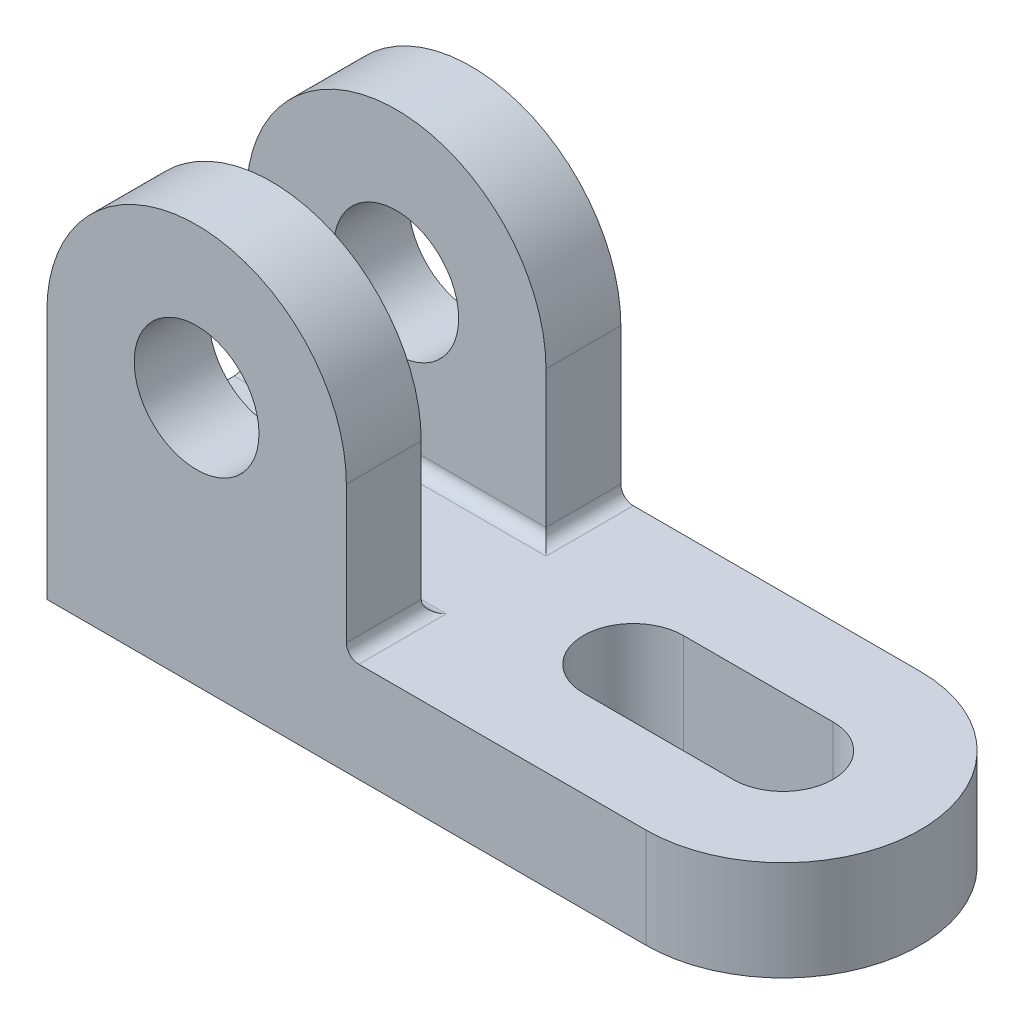
ISO-10303-21;
HEADER;
FILE_DESCRIPTION(('STEP AP214'),'2;1');
FILE_NAME('part.step','',(''),(''),'','','');
FILE_SCHEMA(('AUTOMOTIVE_DESIGN { 1 0 10303 214 1 1 1 1 }'));
ENDSEC;
DATA;
#1=APPLICATION_CONTEXT('core data for automotive mechanical design processes');
#2=APPLICATION_PROTOCOL_DEFINITION('international standard','automotive_design',2000,#1);
#3=PRODUCT_CONTEXT('',#1,'mechanical');
#4=PRODUCT('Part','Part','',(#3));
#5=PRODUCT_RELATED_PRODUCT_CATEGORY('part','',(#4));
#6=PRODUCT_DEFINITION_FORMATION('','',#4);
#7=PRODUCT_DEFINITION_CONTEXT('part definition',#1,'design');
#8=PRODUCT_DEFINITION('design','',#6,#7);
#9=PRODUCT_DEFINITION_SHAPE('','',#8);
#10=(LENGTH_UNIT() NAMED_UNIT(*) SI_UNIT(.MILLI.,.METRE.));
#11=(NAMED_UNIT(*) PLANE_ANGLE_UNIT() SI_UNIT($,.RADIAN.));
#12=(NAMED_UNIT(*) SI_UNIT($,.STERADIAN.) SOLID_ANGLE_UNIT());
#13=UNCERTAINTY_MEASURE_WITH_UNIT(LENGTH_MEASURE(1.E-05),#10,'distance_accuracy_value','');
#14=(GEOMETRIC_REPRESENTATION_CONTEXT(3) GLOBAL_UNCERTAINTY_ASSIGNED_CONTEXT((#13)) GLOBAL_UNIT_ASSIGNED_CONTEXT((#10,
#11,#12)) REPRESENTATION_CONTEXT('',''));
#15=CARTESIAN_POINT('',(0.,0.,0.));
#16=DIRECTION('',(0.,0.,1.));
#17=DIRECTION('',(1.,0.,0.));
#18=AXIS2_PLACEMENT_3D('',#15,#16,#17);
#19=CARTESIAN_POINT('',(0.,16.,0.));
#20=DIRECTION('',(0.,1.,0.));
#21=DIRECTION('',(0.,0.,1.));
#22=AXIS2_PLACEMENT_3D('',#19,#20,#21);
#23=PLANE('',#22);
#24=CARTESIAN_POINT('',(37.,16.,0.));
#25=DIRECTION('',(0.,1.,0.));
#26=DIRECTION('',(0.,0.,1.));
#27=AXIS2_PLACEMENT_3D('',#24,#25,#26);
#28=CIRCLE('',#27,8.);
#29=CARTESIAN_POINT('',(37.,16.,8.00000000000001));
#30=VERTEX_POINT('',#29);
#31=CARTESIAN_POINT('',(37.,16.,-7.99999999999999));
#32=VERTEX_POINT('',#31);
#33=EDGE_CURVE('E235',#30,#32,#28,.T.);
#34=ORIENTED_EDGE('',*,*,#33,.F.);
#35=DIRECTION('',(1.,0.,0.));
#36=VECTOR('',#35,1.);
#37=CARTESIAN_POINT('',(37.,16.,8.00000000000001));
#38=LINE('',#37,#36);
#39=CARTESIAN_POINT('',(13.,16.,8.));
#40=VERTEX_POINT('',#39);
#41=EDGE_CURVE('E244',#40,#30,#38,.T.);
#42=ORIENTED_EDGE('',*,*,#41,.F.);
#43=CARTESIAN_POINT('',(13.,16.,0.));
#44=DIRECTION('',(0.,1.,0.));
#45=DIRECTION('',(0.,0.,1.));
#46=AXIS2_PLACEMENT_3D('',#43,#44,#45);
#47=CIRCLE('',#46,8.);
#48=CARTESIAN_POINT('',(13.,16.,-7.99999999999999));
#49=VERTEX_POINT('',#48);
#50=EDGE_CURVE('E263',#49,#40,#47,.T.);
#51=ORIENTED_EDGE('',*,*,#50,.F.);
#52=DIRECTION('',(-1.,0.,0.));
#53=VECTOR('',#52,1.);
#54=CARTESIAN_POINT('',(37.,16.,-7.99999999999999));
#55=LINE('',#54,#53);
#56=EDGE_CURVE('E259',#32,#49,#55,.T.);
#57=ORIENTED_EDGE('',*,*,#56,.F.);
#58=EDGE_LOOP('',(#34,#42,#51,#57));
#59=FACE_BOUND('',#58,.T.);
#60=DIRECTION('',(0.,0.,-1.));
#61=VECTOR('',#60,1.);
#62=CARTESIAN_POINT('',(-8.99999999999998,16.,0.));
#63=LINE('',#62,#61);
#64=CARTESIAN_POINT('',(-8.99999999999998,16.,-22.));
#65=VERTEX_POINT('',#64);
#66=CARTESIAN_POINT('',(-8.99999999999998,16.,-8.));
#67=VERTEX_POINT('',#66);
#68=EDGE_CURVE('E335',#65,#67,#63,.F.);
#69=ORIENTED_EDGE('',*,*,#68,.T.);
#70=DIRECTION('',(-1.,0.,0.));
#71=VECTOR('',#70,1.);
#72=CARTESIAN_POINT('',(0.,16.,-8.));
#73=LINE('',#72,#71);
#74=CARTESIAN_POINT('',(-59.,16.,-8.));
#75=VERTEX_POINT('',#74);
#76=EDGE_CURVE('E338',#67,#75,#73,.T.);
#77=ORIENTED_EDGE('',*,*,#76,.T.);
#78=DIRECTION('',(0.,0.,1.));
#79=VECTOR('',#78,1.);
#80=CARTESIAN_POINT('',(-59.,16.,0.));
#81=LINE('',#80,#79);
#82=CARTESIAN_POINT('',(-59.,16.,8.));
#83=VERTEX_POINT('',#82);
#84=EDGE_CURVE('E294',#75,#83,#81,.T.);
#85=ORIENTED_EDGE('',*,*,#84,.T.);
#86=DIRECTION('',(-1.,0.,0.));
#87=VECTOR('',#86,1.);
#88=CARTESIAN_POINT('',(0.,16.,8.));
#89=LINE('',#88,#87);
#90=CARTESIAN_POINT('',(-8.99999999999998,16.,8.));
#91=VERTEX_POINT('',#90);
#92=EDGE_CURVE('E332',#83,#91,#89,.F.);
#93=ORIENTED_EDGE('',*,*,#92,.T.);
#94=DIRECTION('',(0.,0.,1.));
#95=VECTOR('',#94,1.);
#96=CARTESIAN_POINT('',(-8.99999999999998,16.,22.));
#97=LINE('',#96,#95);
#98=CARTESIAN_POINT('',(-8.99999999999998,16.,22.));
#99=VERTEX_POINT('',#98);
#100=EDGE_CURVE('E329',#91,#99,#97,.T.);
#101=ORIENTED_EDGE('',*,*,#100,.T.);
#102=DIRECTION('',(1.,0.,0.));
#103=VECTOR('',#102,1.);
#104=CARTESIAN_POINT('',(0.,16.,22.));
#105=LINE('',#104,#103);
#106=CARTESIAN_POINT('',(37.,16.,22.));
#107=VERTEX_POINT('',#106);
#108=EDGE_CURVE('E283',#99,#107,#105,.T.);
#109=ORIENTED_EDGE('',*,*,#108,.T.);
#110=CARTESIAN_POINT('',(37.,16.,0.));
#111=DIRECTION('',(0.,1.,0.));
#112=DIRECTION('',(0.,0.,1.));
#113=AXIS2_PLACEMENT_3D('',#110,#111,#112);
#114=CIRCLE('',#113,22.);
#115=CARTESIAN_POINT('',(37.,16.,-22.));
#116=VERTEX_POINT('',#115);
#117=EDGE_CURVE('E286',#107,#116,#114,.T.);
#118=ORIENTED_EDGE('',*,*,#117,.T.);
#119=DIRECTION('',(1.,0.,0.));
#120=VECTOR('',#119,1.);
#121=CARTESIAN_POINT('',(0.,16.,-22.));
#122=LINE('',#121,#120);
#123=EDGE_CURVE('E291',#65,#116,#122,.T.);
#124=ORIENTED_EDGE('',*,*,#123,.F.);
#125=EDGE_LOOP('',(#69,#77,#85,#93,#101,#109,#118,#124));
#126=FACE_BOUND('',#125,.T.);
#127=ADVANCED_FACE('F39',(#59,#126),#23,.T.);
#128=CARTESIAN_POINT('',(0.,16.,22.));
#129=DIRECTION('',(0.,0.,-1.));
#130=DIRECTION('',(-1.,0.,0.));
#131=AXIS2_PLACEMENT_3D('',#128,#129,#130);
#132=PLANE('',#131);
#133=DIRECTION('',(1.,0.,0.));
#134=VECTOR('',#133,1.);
#135=CARTESIAN_POINT('',(0.,0.,22.));
#136=LINE('',#135,#134);
#137=CARTESIAN_POINT('',(-59.,0.,22.));
#138=VERTEX_POINT('',#137);
#139=CARTESIAN_POINT('',(37.,0.,22.));
#140=VERTEX_POINT('',#139);
#141=EDGE_CURVE('E273',#138,#140,#136,.T.);
#142=ORIENTED_EDGE('',*,*,#141,.T.);
#143=DIRECTION('',(0.,-1.,0.));
#144=VECTOR('',#143,1.);
#145=CARTESIAN_POINT('',(37.,16.,22.));
#146=LINE('',#145,#144);
#147=EDGE_CURVE('E321',#107,#140,#146,.T.);
#148=ORIENTED_EDGE('',*,*,#147,.F.);
#149=ORIENTED_EDGE('',*,*,#108,.F.);
#150=CARTESIAN_POINT('',(-8.99999999999998,18.,22.));
#151=DIRECTION('',(0.,0.,-1.));
#152=DIRECTION('',(-1.,0.,0.));
#153=AXIS2_PLACEMENT_3D('',#150,#151,#152);
#154=CIRCLE('',#153,2.);
#155=CARTESIAN_POINT('',(-11.,18.,22.));
#156=VERTEX_POINT('',#155);
#157=EDGE_CURVE('E11',#99,#156,#154,.T.);
#158=ORIENTED_EDGE('',*,*,#157,.T.);
#159=DIRECTION('',(0.,1.,0.));
#160=VECTOR('',#159,1.);
#161=CARTESIAN_POINT('',(-11.,0.,22.));
#162=LINE('',#161,#160);
#163=CARTESIAN_POINT('',(-11.,40.,22.));
#164=VERTEX_POINT('',#163);
#165=EDGE_CURVE('E211',#156,#164,#162,.T.);
#166=ORIENTED_EDGE('',*,*,#165,.T.);
#167=CARTESIAN_POINT('',(-35.,40.,22.));
#168=DIRECTION('',(0.,0.,1.));
#169=DIRECTION('',(1.,0.,0.));
#170=AXIS2_PLACEMENT_3D('',#167,#168,#169);
#171=CIRCLE('',#170,24.);
#172=CARTESIAN_POINT('',(-59.,40.,22.));
#173=VERTEX_POINT('',#172);
#174=EDGE_CURVE('E225',#164,#173,#171,.T.);
#175=ORIENTED_EDGE('',*,*,#174,.T.);
#176=DIRECTION('',(0.,-1.,0.));
#177=VECTOR('',#176,1.);
#178=CARTESIAN_POINT('',(-59.,16.,22.));
#179=LINE('',#178,#177);
#180=EDGE_CURVE('E298',#173,#138,#179,.T.);
#181=ORIENTED_EDGE('',*,*,#180,.T.);
#182=EDGE_LOOP('',(#142,#148,#149,#158,#166,#175,#181));
#183=FACE_BOUND('',#182,.T.);
#184=CARTESIAN_POINT('',(-35.,40.,22.));
#185=DIRECTION('',(0.,0.,1.));
#186=DIRECTION('',(1.,0.,0.));
#187=AXIS2_PLACEMENT_3D('',#184,#185,#186);
#188=CIRCLE('',#187,10.);
#189=CARTESIAN_POINT('',(-25.,40.,22.));
#190=VERTEX_POINT('',#189);
#191=EDGE_CURVE('E204',#190,#190,#188,.T.);
#192=ORIENTED_EDGE('',*,*,#191,.F.);
#193=EDGE_LOOP('',(#192));
#194=FACE_BOUND('',#193,.T.);
#195=ADVANCED_FACE('F389',(#183,#194),#132,.F.);
#196=CARTESIAN_POINT('',(37.,16.,0.));
#197=DIRECTION('',(0.,-1.,0.));
#198=DIRECTION('',(0.,0.,-1.));
#199=AXIS2_PLACEMENT_3D('',#196,#197,#198);
#200=CYLINDRICAL_SURFACE('',#199,22.);
#201=CARTESIAN_POINT('',(37.,0.,0.));
#202=DIRECTION('',(0.,1.,0.));
#203=DIRECTION('',(0.,0.,1.));
#204=AXIS2_PLACEMENT_3D('',#201,#202,#203);
#205=CIRCLE('',#204,22.);
#206=CARTESIAN_POINT('',(37.,0.,-22.));
#207=VERTEX_POINT('',#206);
#208=EDGE_CURVE('E302',#140,#207,#205,.T.);
#209=ORIENTED_EDGE('',*,*,#208,.T.);
#210=DIRECTION('',(0.,-1.,0.));
#211=VECTOR('',#210,1.);
#212=CARTESIAN_POINT('',(37.,16.,-22.));
#213=LINE('',#212,#211);
#214=EDGE_CURVE('E318',#116,#207,#213,.T.);
#215=ORIENTED_EDGE('',*,*,#214,.F.);
#216=ORIENTED_EDGE('',*,*,#117,.F.);
#217=ORIENTED_EDGE('',*,*,#147,.T.);
#218=EDGE_LOOP('',(#209,#215,#216,#217));
#219=FACE_BOUND('',#218,.T.);
#220=ADVANCED_FACE('F381',(#219),#200,.T.);
#221=CARTESIAN_POINT('',(0.,16.,-22.));
#222=DIRECTION('',(0.,0.,-1.));
#223=DIRECTION('',(-1.,0.,0.));
#224=AXIS2_PLACEMENT_3D('',#221,#222,#223);
#225=PLANE('',#224);
#226=DIRECTION('',(1.,0.,0.));
#227=VECTOR('',#226,1.);
#228=CARTESIAN_POINT('',(0.,0.,-22.));
#229=LINE('',#228,#227);
#230=CARTESIAN_POINT('',(-59.,0.,-22.));
#231=VERTEX_POINT('',#230);
#232=EDGE_CURVE('E306',#231,#207,#229,.T.);
#233=ORIENTED_EDGE('',*,*,#232,.F.);
#234=DIRECTION('',(0.,-1.,0.));
#235=VECTOR('',#234,1.);
#236=CARTESIAN_POINT('',(-59.,16.,-22.));
#237=LINE('',#236,#235);
#238=CARTESIAN_POINT('',(-59.,40.,-22.));
#239=VERTEX_POINT('',#238);
#240=EDGE_CURVE('E315',#239,#231,#237,.T.);
#241=ORIENTED_EDGE('',*,*,#240,.F.);
#242=CARTESIAN_POINT('',(-35.,40.,-22.));
#243=DIRECTION('',(0.,0.,1.));
#244=DIRECTION('',(1.,0.,0.));
#245=AXIS2_PLACEMENT_3D('',#242,#243,#244);
#246=CIRCLE('',#245,24.);
#247=CARTESIAN_POINT('',(-11.,40.,-22.));
#248=VERTEX_POINT('',#247);
#249=EDGE_CURVE('E197',#248,#239,#246,.T.);
#250=ORIENTED_EDGE('',*,*,#249,.F.);
#251=DIRECTION('',(0.,1.,0.));
#252=VECTOR('',#251,1.);
#253=CARTESIAN_POINT('',(-11.,0.,-22.));
#254=LINE('',#253,#252);
#255=CARTESIAN_POINT('',(-11.,18.,-22.));
#256=VERTEX_POINT('',#255);
#257=EDGE_CURVE('E175',#256,#248,#254,.T.);
#258=ORIENTED_EDGE('',*,*,#257,.F.);
#259=CARTESIAN_POINT('',(-8.99999999999998,18.,-22.));
#260=DIRECTION('',(0.,0.,-1.));
#261=DIRECTION('',(-1.,0.,0.));
#262=AXIS2_PLACEMENT_3D('',#259,#260,#261);
#263=CIRCLE('',#262,2.);
#264=EDGE_CURVE('E49',#256,#65,#263,.F.);
#265=ORIENTED_EDGE('',*,*,#264,.T.);
#266=ORIENTED_EDGE('',*,*,#123,.T.);
#267=ORIENTED_EDGE('',*,*,#214,.T.);
#268=EDGE_LOOP('',(#233,#241,#250,#258,#265,#266,#267));
#269=FACE_BOUND('',#268,.T.);
#270=CARTESIAN_POINT('',(-35.,40.,-22.));
#271=DIRECTION('',(0.,0.,1.));
#272=DIRECTION('',(1.,0.,0.));
#273=AXIS2_PLACEMENT_3D('',#270,#271,#272);
#274=CIRCLE('',#273,10.);
#275=CARTESIAN_POINT('',(-25.,40.,-22.));
#276=VERTEX_POINT('',#275);
#277=EDGE_CURVE('E193',#276,#276,#274,.T.);
#278=ORIENTED_EDGE('',*,*,#277,.T.);
#279=EDGE_LOOP('',(#278));
#280=FACE_BOUND('',#279,.T.);
#281=ADVANCED_FACE('F374',(#269,#280),#225,.T.);
#282=CARTESIAN_POINT('',(-59.,16.,0.));
#283=DIRECTION('',(1.,0.,0.));
#284=DIRECTION('',(0.,0.,-1.));
#285=AXIS2_PLACEMENT_3D('',#282,#283,#284);
#286=PLANE('',#285);
#287=DIRECTION('',(0.,0.,1.));
#288=VECTOR('',#287,1.);
#289=CARTESIAN_POINT('',(-59.,0.,0.));
#290=LINE('',#289,#288);
#291=EDGE_CURVE('E287',#231,#138,#290,.T.);
#292=ORIENTED_EDGE('',*,*,#291,.T.);
#293=ORIENTED_EDGE('',*,*,#180,.F.);
#294=DIRECTION('',(0.,0.,1.));
#295=VECTOR('',#294,1.);
#296=CARTESIAN_POINT('',(-59.,40.,10.));
#297=LINE('',#296,#295);
#298=CARTESIAN_POINT('',(-59.,40.,10.));
#299=VERTEX_POINT('',#298);
#300=EDGE_CURVE('E221',#299,#173,#297,.T.);
#301=ORIENTED_EDGE('',*,*,#300,.F.);
#302=DIRECTION('',(0.,1.,0.));
#303=VECTOR('',#302,1.);
#304=CARTESIAN_POINT('',(-59.,0.,10.));
#305=LINE('',#304,#303);
#306=CARTESIAN_POINT('',(-59.,18.,10.));
#307=VERTEX_POINT('',#306);
#308=EDGE_CURVE('E215',#307,#299,#305,.T.);
#309=ORIENTED_EDGE('',*,*,#308,.F.);
#310=CARTESIAN_POINT('',(-59.,18.,8.));
#311=DIRECTION('',(1.,0.,0.));
#312=DIRECTION('',(0.,0.,-1.));
#313=AXIS2_PLACEMENT_3D('',#310,#311,#312);
#314=CIRCLE('',#313,2.);
#315=EDGE_CURVE('E349',#307,#83,#314,.T.);
#316=ORIENTED_EDGE('',*,*,#315,.T.);
#317=ORIENTED_EDGE('',*,*,#84,.F.);
#318=CARTESIAN_POINT('',(-59.,18.,-8.));
#319=DIRECTION('',(1.,0.,0.));
#320=DIRECTION('',(0.,0.,-1.));
#321=AXIS2_PLACEMENT_3D('',#318,#319,#320);
#322=CIRCLE('',#321,2.);
#323=CARTESIAN_POINT('',(-59.,18.,-10.));
#324=VERTEX_POINT('',#323);
#325=EDGE_CURVE('E352',#75,#324,#322,.T.);
#326=ORIENTED_EDGE('',*,*,#325,.T.);
#327=DIRECTION('',(0.,1.,0.));
#328=VECTOR('',#327,1.);
#329=CARTESIAN_POINT('',(-59.,0.,-10.));
#330=LINE('',#329,#328);
#331=CARTESIAN_POINT('',(-59.,40.,-10.));
#332=VERTEX_POINT('',#331);
#333=EDGE_CURVE('E170',#324,#332,#330,.T.);
#334=ORIENTED_EDGE('',*,*,#333,.T.);
#335=DIRECTION('',(0.,0.,-1.));
#336=VECTOR('',#335,1.);
#337=CARTESIAN_POINT('',(-59.,40.,-10.));
#338=LINE('',#337,#336);
#339=EDGE_CURVE('E180',#332,#239,#338,.T.);
#340=ORIENTED_EDGE('',*,*,#339,.T.);
#341=ORIENTED_EDGE('',*,*,#240,.T.);
#342=EDGE_LOOP('',(#292,#293,#301,#309,#316,#317,#326,#334,#340,#341));
#343=FACE_BOUND('',#342,.T.);
#344=ADVANCED_FACE('F387',(#343),#286,.F.);
#345=CARTESIAN_POINT('',(0.,0.,0.));
#346=DIRECTION('',(0.,1.,0.));
#347=DIRECTION('',(0.,0.,1.));
#348=AXIS2_PLACEMENT_3D('',#345,#346,#347);
#349=PLANE('',#348);
#350=DIRECTION('',(1.,0.,0.));
#351=VECTOR('',#350,1.);
#352=CARTESIAN_POINT('',(37.,0.,8.00000000000001));
#353=LINE('',#352,#351);
#354=CARTESIAN_POINT('',(13.,0.,8.));
#355=VERTEX_POINT('',#354);
#356=CARTESIAN_POINT('',(37.,0.,8.00000000000001));
#357=VERTEX_POINT('',#356);
#358=EDGE_CURVE('E252',#355,#357,#353,.T.);
#359=ORIENTED_EDGE('',*,*,#358,.T.);
#360=CARTESIAN_POINT('',(37.,0.,0.));
#361=DIRECTION('',(0.,1.,0.));
#362=DIRECTION('',(0.,0.,1.));
#363=AXIS2_PLACEMENT_3D('',#360,#361,#362);
#364=CIRCLE('',#363,8.);
#365=CARTESIAN_POINT('',(37.,0.,-7.99999999999999));
#366=VERTEX_POINT('',#365);
#367=EDGE_CURVE('E239',#357,#366,#364,.T.);
#368=ORIENTED_EDGE('',*,*,#367,.T.);
#369=DIRECTION('',(-1.,0.,0.));
#370=VECTOR('',#369,1.);
#371=CARTESIAN_POINT('',(37.,0.,-7.99999999999999));
#372=LINE('',#371,#370);
#373=CARTESIAN_POINT('',(13.,0.,-7.99999999999999));
#374=VERTEX_POINT('',#373);
#375=EDGE_CURVE('E243',#366,#374,#372,.T.);
#376=ORIENTED_EDGE('',*,*,#375,.T.);
#377=CARTESIAN_POINT('',(13.,0.,0.));
#378=DIRECTION('',(0.,1.,0.));
#379=DIRECTION('',(0.,0.,1.));
#380=AXIS2_PLACEMENT_3D('',#377,#378,#379);
#381=CIRCLE('',#380,8.);
#382=EDGE_CURVE('E248',#374,#355,#381,.T.);
#383=ORIENTED_EDGE('',*,*,#382,.T.);
#384=EDGE_LOOP('',(#359,#368,#376,#383));
#385=FACE_BOUND('',#384,.T.);
#386=ORIENTED_EDGE('',*,*,#141,.F.);
#387=ORIENTED_EDGE('',*,*,#291,.F.);
#388=ORIENTED_EDGE('',*,*,#232,.T.);
#389=ORIENTED_EDGE('',*,*,#208,.F.);
#390=EDGE_LOOP('',(#386,#387,#388,#389));
#391=FACE_BOUND('',#390,.T.);
#392=ADVANCED_FACE('F385',(#385,#391),#349,.F.);
#393=CARTESIAN_POINT('',(37.,0.,0.));
#394=DIRECTION('',(0.,1.,0.));
#395=DIRECTION('',(0.,0.,1.));
#396=AXIS2_PLACEMENT_3D('',#393,#394,#395);
#397=CYLINDRICAL_SURFACE('',#396,8.);
#398=ORIENTED_EDGE('',*,*,#33,.T.);
#399=DIRECTION('',(0.,1.,0.));
#400=VECTOR('',#399,1.);
#401=CARTESIAN_POINT('',(37.,0.,-7.99999999999999));
#402=LINE('',#401,#400);
#403=EDGE_CURVE('E256',#366,#32,#402,.T.);
#404=ORIENTED_EDGE('',*,*,#403,.F.);
#405=ORIENTED_EDGE('',*,*,#367,.F.);
#406=DIRECTION('',(0.,1.,0.));
#407=VECTOR('',#406,1.);
#408=CARTESIAN_POINT('',(37.,0.,8.00000000000001));
#409=LINE('',#408,#407);
#410=EDGE_CURVE('E270',#357,#30,#409,.T.);
#411=ORIENTED_EDGE('',*,*,#410,.T.);
#412=EDGE_LOOP('',(#398,#404,#405,#411));
#413=FACE_BOUND('',#412,.T.);
#414=ADVANCED_FACE('F430',(#413),#397,.F.);
#415=CARTESIAN_POINT('',(37.,0.,8.00000000000001));
#416=DIRECTION('',(0.,0.,1.));
#417=DIRECTION('',(1.,0.,0.));
#418=AXIS2_PLACEMENT_3D('',#415,#416,#417);
#419=PLANE('',#418);
#420=ORIENTED_EDGE('',*,*,#41,.T.);
#421=ORIENTED_EDGE('',*,*,#410,.F.);
#422=ORIENTED_EDGE('',*,*,#358,.F.);
#423=DIRECTION('',(0.,1.,0.));
#424=VECTOR('',#423,1.);
#425=CARTESIAN_POINT('',(13.,0.,8.));
#426=LINE('',#425,#424);
#427=EDGE_CURVE('E274',#355,#40,#426,.T.);
#428=ORIENTED_EDGE('',*,*,#427,.T.);
#429=EDGE_LOOP('',(#420,#421,#422,#428));
#430=FACE_BOUND('',#429,.T.);
#431=ADVANCED_FACE('F523',(#430),#419,.F.);
#432=CARTESIAN_POINT('',(13.,0.,0.));
#433=DIRECTION('',(0.,1.,0.));
#434=DIRECTION('',(0.,0.,1.));
#435=AXIS2_PLACEMENT_3D('',#432,#433,#434);
#436=CYLINDRICAL_SURFACE('',#435,8.);
#437=ORIENTED_EDGE('',*,*,#50,.T.);
#438=ORIENTED_EDGE('',*,*,#427,.F.);
#439=ORIENTED_EDGE('',*,*,#382,.F.);
#440=DIRECTION('',(0.,1.,0.));
#441=VECTOR('',#440,1.);
#442=CARTESIAN_POINT('',(13.,0.,-7.99999999999999));
#443=LINE('',#442,#441);
#444=EDGE_CURVE('E277',#374,#49,#443,.T.);
#445=ORIENTED_EDGE('',*,*,#444,.T.);
#446=EDGE_LOOP('',(#437,#438,#439,#445));
#447=FACE_BOUND('',#446,.T.);
#448=ADVANCED_FACE('F513',(#447),#436,.F.);
#449=CARTESIAN_POINT('',(37.,0.,-7.99999999999999));
#450=DIRECTION('',(0.,0.,-1.));
#451=DIRECTION('',(-1.,0.,0.));
#452=AXIS2_PLACEMENT_3D('',#449,#450,#451);
#453=PLANE('',#452);
#454=ORIENTED_EDGE('',*,*,#56,.T.);
#455=ORIENTED_EDGE('',*,*,#444,.F.);
#456=ORIENTED_EDGE('',*,*,#375,.F.);
#457=ORIENTED_EDGE('',*,*,#403,.T.);
#458=EDGE_LOOP('',(#454,#455,#456,#457));
#459=FACE_BOUND('',#458,.T.);
#460=ADVANCED_FACE('F417',(#459),#453,.F.);
#461=CARTESIAN_POINT('',(-35.,40.,10.));
#462=DIRECTION('',(0.,0.,1.));
#463=DIRECTION('',(1.,0.,0.));
#464=AXIS2_PLACEMENT_3D('',#461,#462,#463);
#465=CYLINDRICAL_SURFACE('',#464,24.);
#466=ORIENTED_EDGE('',*,*,#174,.F.);
#467=DIRECTION('',(0.,0.,1.));
#468=VECTOR('',#467,1.);
#469=CARTESIAN_POINT('',(-11.,40.,10.));
#470=LINE('',#469,#468);
#471=CARTESIAN_POINT('',(-11.,40.,10.));
#472=VERTEX_POINT('',#471);
#473=EDGE_CURVE('E231',#472,#164,#470,.T.);
#474=ORIENTED_EDGE('',*,*,#473,.F.);
#475=CARTESIAN_POINT('',(-35.,40.,10.));
#476=DIRECTION('',(0.,0.,1.));
#477=DIRECTION('',(1.,0.,0.));
#478=AXIS2_PLACEMENT_3D('',#475,#476,#477);
#479=CIRCLE('',#478,24.);
#480=EDGE_CURVE('E210',#472,#299,#479,.T.);
#481=ORIENTED_EDGE('',*,*,#480,.T.);
#482=ORIENTED_EDGE('',*,*,#300,.T.);
#483=EDGE_LOOP('',(#466,#474,#481,#482));
#484=FACE_BOUND('',#483,.T.);
#485=ADVANCED_FACE('F394',(#484),#465,.T.);
#486=CARTESIAN_POINT('',(-11.,0.,10.));
#487=DIRECTION('',(1.,0.,0.));
#488=DIRECTION('',(0.,0.,-1.));
#489=AXIS2_PLACEMENT_3D('',#486,#487,#488);
#490=PLANE('',#489);
#491=ORIENTED_EDGE('',*,*,#165,.F.);
#492=DIRECTION('',(0.,0.,1.));
#493=VECTOR('',#492,1.);
#494=CARTESIAN_POINT('',(-11.,18.,10.));
#495=LINE('',#494,#493);
#496=CARTESIAN_POINT('',(-11.,18.,10.));
#497=VERTEX_POINT('',#496);
#498=EDGE_CURVE('E346',#156,#497,#495,.F.);
#499=ORIENTED_EDGE('',*,*,#498,.T.);
#500=DIRECTION('',(0.,1.,0.));
#501=VECTOR('',#500,1.);
#502=CARTESIAN_POINT('',(-11.,0.,10.));
#503=LINE('',#502,#501);
#504=EDGE_CURVE('E218',#497,#472,#503,.T.);
#505=ORIENTED_EDGE('',*,*,#504,.T.);
#506=ORIENTED_EDGE('',*,*,#473,.T.);
#507=EDGE_LOOP('',(#491,#499,#505,#506));
#508=FACE_BOUND('',#507,.T.);
#509=ADVANCED_FACE('F407',(#508),#490,.T.);
#510=CARTESIAN_POINT('',(-35.,40.,10.));
#511=DIRECTION('',(0.,0.,1.));
#512=DIRECTION('',(1.,0.,0.));
#513=AXIS2_PLACEMENT_3D('',#510,#511,#512);
#514=CYLINDRICAL_SURFACE('',#513,10.);
#515=CARTESIAN_POINT('',(-35.,40.,10.));
#516=DIRECTION('',(0.,0.,1.));
#517=DIRECTION('',(1.,0.,0.));
#518=AXIS2_PLACEMENT_3D('',#515,#516,#517);
#519=CIRCLE('',#518,10.);
#520=CARTESIAN_POINT('',(-25.,40.,10.));
#521=VERTEX_POINT('',#520);
#522=EDGE_CURVE('E206',#521,#521,#519,.T.);
#523=ORIENTED_EDGE('',*,*,#522,.F.);
#524=EDGE_LOOP('',(#523));
#525=FACE_BOUND('',#524,.T.);
#526=ORIENTED_EDGE('',*,*,#191,.T.);
#527=EDGE_LOOP('',(#526));
#528=FACE_BOUND('',#527,.T.);
#529=ADVANCED_FACE('F409',(#525,#528),#514,.F.);
#530=CARTESIAN_POINT('',(0.,0.,10.));
#531=DIRECTION('',(0.,0.,1.));
#532=DIRECTION('',(1.,0.,0.));
#533=AXIS2_PLACEMENT_3D('',#530,#531,#532);
#534=PLANE('',#533);
#535=ORIENTED_EDGE('',*,*,#522,.T.);
#536=EDGE_LOOP('',(#535));
#537=FACE_BOUND('',#536,.T.);
#538=ORIENTED_EDGE('',*,*,#504,.F.);
#539=DIRECTION('',(-1.,0.,0.));
#540=VECTOR('',#539,1.);
#541=CARTESIAN_POINT('',(0.,18.,10.));
#542=LINE('',#541,#540);
#543=EDGE_CURVE('E325',#497,#307,#542,.T.);
#544=ORIENTED_EDGE('',*,*,#543,.T.);
#545=ORIENTED_EDGE('',*,*,#308,.T.);
#546=ORIENTED_EDGE('',*,*,#480,.F.);
#547=EDGE_LOOP('',(#538,#544,#545,#546));
#548=FACE_BOUND('',#547,.T.);
#549=ADVANCED_FACE('F400',(#537,#548),#534,.F.);
#550=CARTESIAN_POINT('',(-35.,40.,-10.));
#551=DIRECTION('',(0.,0.,-1.));
#552=DIRECTION('',(-1.,0.,0.));
#553=AXIS2_PLACEMENT_3D('',#550,#551,#552);
#554=CYLINDRICAL_SURFACE('',#553,24.);
#555=ORIENTED_EDGE('',*,*,#249,.T.);
#556=ORIENTED_EDGE('',*,*,#339,.F.);
#557=CARTESIAN_POINT('',(-35.,40.,-10.));
#558=DIRECTION('',(0.,0.,1.));
#559=DIRECTION('',(1.,0.,0.));
#560=AXIS2_PLACEMENT_3D('',#557,#558,#559);
#561=CIRCLE('',#560,24.);
#562=CARTESIAN_POINT('',(-11.,40.,-10.));
#563=VERTEX_POINT('',#562);
#564=EDGE_CURVE('E165',#563,#332,#561,.T.);
#565=ORIENTED_EDGE('',*,*,#564,.F.);
#566=DIRECTION('',(0.,0.,-1.));
#567=VECTOR('',#566,1.);
#568=CARTESIAN_POINT('',(-11.,40.,-10.));
#569=LINE('',#568,#567);
#570=EDGE_CURVE('E173',#563,#248,#569,.T.);
#571=ORIENTED_EDGE('',*,*,#570,.T.);
#572=EDGE_LOOP('',(#555,#556,#565,#571));
#573=FACE_BOUND('',#572,.T.);
#574=ADVANCED_FACE('F182',(#573),#554,.T.);
#575=CARTESIAN_POINT('',(-35.,40.,-10.));
#576=DIRECTION('',(0.,0.,-1.));
#577=DIRECTION('',(-1.,0.,0.));
#578=AXIS2_PLACEMENT_3D('',#575,#576,#577);
#579=CYLINDRICAL_SURFACE('',#578,10.);
#580=CARTESIAN_POINT('',(-35.,40.,-10.));
#581=DIRECTION('',(0.,0.,1.));
#582=DIRECTION('',(1.,0.,0.));
#583=AXIS2_PLACEMENT_3D('',#580,#581,#582);
#584=CIRCLE('',#583,10.);
#585=CARTESIAN_POINT('',(-25.,40.,-10.));
#586=VERTEX_POINT('',#585);
#587=EDGE_CURVE('E185',#586,#586,#584,.T.);
#588=ORIENTED_EDGE('',*,*,#587,.T.);
#589=EDGE_LOOP('',(#588));
#590=FACE_BOUND('',#589,.T.);
#591=ORIENTED_EDGE('',*,*,#277,.F.);
#592=EDGE_LOOP('',(#591));
#593=FACE_BOUND('',#592,.T.);
#594=ADVANCED_FACE('F471',(#590,#593),#579,.F.);
#595=CARTESIAN_POINT('',(-11.,0.,-10.));
#596=DIRECTION('',(-1.,0.,0.));
#597=DIRECTION('',(0.,0.,1.));
#598=AXIS2_PLACEMENT_3D('',#595,#596,#597);
#599=PLANE('',#598);
#600=DIRECTION('',(0.,1.,0.));
#601=VECTOR('',#600,1.);
#602=CARTESIAN_POINT('',(-11.,0.,-10.));
#603=LINE('',#602,#601);
#604=CARTESIAN_POINT('',(-11.,18.,-10.));
#605=VERTEX_POINT('',#604);
#606=EDGE_CURVE('E160',#605,#563,#603,.T.);
#607=ORIENTED_EDGE('',*,*,#606,.F.);
#608=DIRECTION('',(0.,0.,-1.));
#609=VECTOR('',#608,1.);
#610=CARTESIAN_POINT('',(-11.,18.,-10.));
#611=LINE('',#610,#609);
#612=EDGE_CURVE('E63',#605,#256,#611,.T.);
#613=ORIENTED_EDGE('',*,*,#612,.T.);
#614=ORIENTED_EDGE('',*,*,#257,.T.);
#615=ORIENTED_EDGE('',*,*,#570,.F.);
#616=EDGE_LOOP('',(#607,#613,#614,#615));
#617=FACE_BOUND('',#616,.T.);
#618=ADVANCED_FACE('F174',(#617),#599,.F.);
#619=CARTESIAN_POINT('',(0.,0.,-10.));
#620=DIRECTION('',(0.,0.,-1.));
#621=DIRECTION('',(1.,0.,0.));
#622=AXIS2_PLACEMENT_3D('',#619,#620,#621);
#623=PLANE('',#622);
#624=ORIENTED_EDGE('',*,*,#587,.F.);
#625=EDGE_LOOP('',(#624));
#626=FACE_BOUND('',#625,.T.);
#627=ORIENTED_EDGE('',*,*,#333,.F.);
#628=DIRECTION('',(-1.,0.,0.));
#629=VECTOR('',#628,1.);
#630=CARTESIAN_POINT('',(0.,18.,-10.));
#631=LINE('',#630,#629);
#632=EDGE_CURVE('E168',#324,#605,#631,.F.);
#633=ORIENTED_EDGE('',*,*,#632,.T.);
#634=ORIENTED_EDGE('',*,*,#606,.T.);
#635=ORIENTED_EDGE('',*,*,#564,.T.);
#636=EDGE_LOOP('',(#627,#633,#634,#635));
#637=FACE_BOUND('',#636,.T.);
#638=ADVANCED_FACE('F163',(#626,#637),#623,.F.);
#639=CARTESIAN_POINT('',(-8.99999999999998,18.,0.));
#640=DIRECTION('',(0.,0.,-1.));
#641=DIRECTION('',(-1.,0.,0.));
#642=AXIS2_PLACEMENT_3D('',#639,#640,#641);
#643=CYLINDRICAL_SURFACE('',#642,2.);
#644=ORIENTED_EDGE('',*,*,#157,.F.);
#645=ORIENTED_EDGE('',*,*,#100,.F.);
#646=CARTESIAN_POINT('',(-8.99999999999998,18.,8.));
#647=DIRECTION('',(-0.707106781186547,0.,-0.707106781186547));
#648=DIRECTION('',(0.707106781186547,0.,-0.707106781186547));
#649=AXIS2_PLACEMENT_3D('',#646,#647,#648);
#650=ELLIPSE('',#649,2.82842712474619,2.);
#651=EDGE_CURVE('E198',#497,#91,#650,.F.);
#652=ORIENTED_EDGE('',*,*,#651,.F.);
#653=ORIENTED_EDGE('',*,*,#498,.F.);
#654=EDGE_LOOP('',(#644,#645,#652,#653));
#655=FACE_BOUND('',#654,.T.);
#656=ADVANCED_FACE('F404',(#655),#643,.F.);
#657=CARTESIAN_POINT('',(0.,18.,8.));
#658=DIRECTION('',(-1.,0.,0.));
#659=DIRECTION('',(0.,0.,1.));
#660=AXIS2_PLACEMENT_3D('',#657,#658,#659);
#661=CYLINDRICAL_SURFACE('',#660,2.);
#662=ORIENTED_EDGE('',*,*,#651,.T.);
#663=ORIENTED_EDGE('',*,*,#92,.F.);
#664=ORIENTED_EDGE('',*,*,#315,.F.);
#665=ORIENTED_EDGE('',*,*,#543,.F.);
#666=EDGE_LOOP('',(#662,#663,#664,#665));
#667=FACE_BOUND('',#666,.T.);
#668=ADVANCED_FACE('F401',(#667),#661,.F.);
#669=CARTESIAN_POINT('',(-8.99999999999998,18.,-10.));
#670=DIRECTION('',(0.,0.,-1.));
#671=DIRECTION('',(-1.,0.,0.));
#672=AXIS2_PLACEMENT_3D('',#669,#670,#671);
#673=CYLINDRICAL_SURFACE('',#672,2.);
#674=ORIENTED_EDGE('',*,*,#264,.F.);
#675=ORIENTED_EDGE('',*,*,#612,.F.);
#676=CARTESIAN_POINT('',(-8.99999999999998,18.,-8.));
#677=DIRECTION('',(0.707106781186547,0.,-0.707106781186547));
#678=DIRECTION('',(-0.707106781186547,0.,-0.707106781186547));
#679=AXIS2_PLACEMENT_3D('',#676,#677,#678);
#680=ELLIPSE('',#679,2.82842712474619,2.);
#681=EDGE_CURVE('E43',#67,#605,#680,.T.);
#682=ORIENTED_EDGE('',*,*,#681,.F.);
#683=ORIENTED_EDGE('',*,*,#68,.F.);
#684=EDGE_LOOP('',(#674,#675,#682,#683));
#685=FACE_BOUND('',#684,.T.);
#686=ADVANCED_FACE('F41',(#685),#673,.F.);
#687=CARTESIAN_POINT('',(0.,18.,-8.));
#688=DIRECTION('',(-1.,0.,0.));
#689=DIRECTION('',(0.,0.,1.));
#690=AXIS2_PLACEMENT_3D('',#687,#688,#689);
#691=CYLINDRICAL_SURFACE('',#690,2.);
#692=ORIENTED_EDGE('',*,*,#681,.T.);
#693=ORIENTED_EDGE('',*,*,#632,.F.);
#694=ORIENTED_EDGE('',*,*,#325,.F.);
#695=ORIENTED_EDGE('',*,*,#76,.F.);
#696=EDGE_LOOP('',(#692,#693,#694,#695));
#697=FACE_BOUND('',#696,.T.);
#698=ADVANCED_FACE('F367',(#697),#691,.F.);
#699=CLOSED_SHELL('',(#127,#195,#220,#281,#344,#392,#414,#431,#448,#460,#485,#509,#529,#549,
#574,#594,#618,#638,#656,#668,#686,#698));
#700=MANIFOLD_SOLID_BREP('B2',#699);
#701=ADVANCED_BREP_SHAPE_REPRESENTATION('',(#18,#700),#14);
#702=SHAPE_DEFINITION_REPRESENTATION(#9,#701);
ENDSEC;
END-ISO-10303-21;
